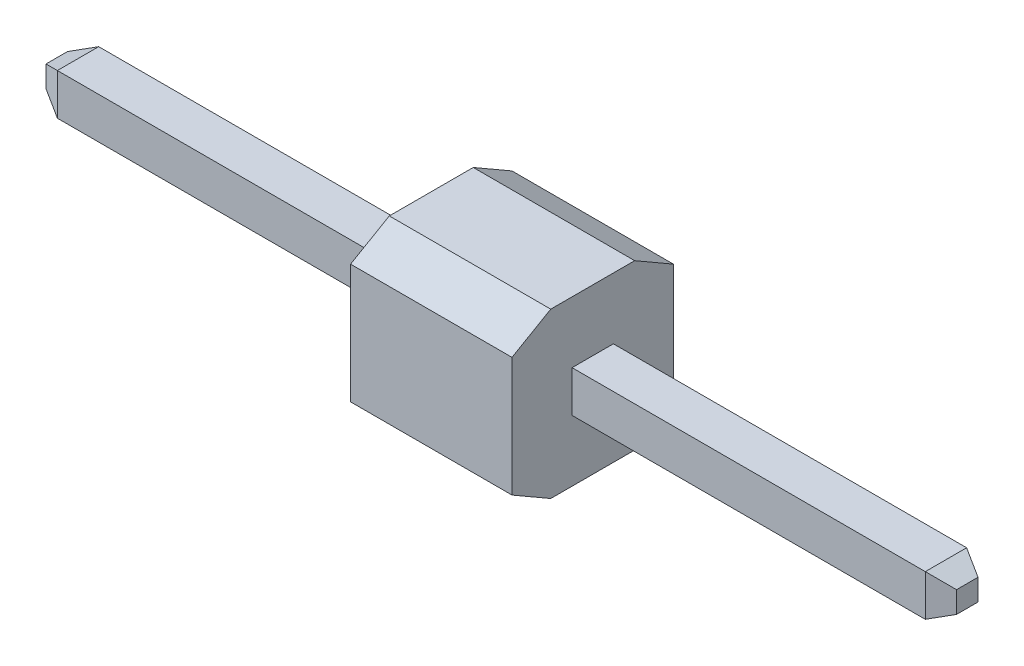
ISO-10303-21;
HEADER;
FILE_DESCRIPTION(('STEP AP214'),'2;1');
FILE_NAME('part.step','',(''),(''),'','','');
FILE_SCHEMA(('AUTOMOTIVE_DESIGN { 1 0 10303 214 1 1 1 1 }'));
ENDSEC;
DATA;
#1=APPLICATION_CONTEXT('core data for automotive mechanical design processes');
#2=APPLICATION_PROTOCOL_DEFINITION('international standard','automotive_design',2000,#1);
#3=PRODUCT_CONTEXT('',#1,'mechanical');
#4=PRODUCT('Part','Part','',(#3));
#5=PRODUCT_RELATED_PRODUCT_CATEGORY('part','',(#4));
#6=PRODUCT_DEFINITION_FORMATION('','',#4);
#7=PRODUCT_DEFINITION_CONTEXT('part definition',#1,'design');
#8=PRODUCT_DEFINITION('design','',#6,#7);
#9=PRODUCT_DEFINITION_SHAPE('','',#8);
#10=(LENGTH_UNIT() NAMED_UNIT(*) SI_UNIT(.MILLI.,.METRE.));
#11=(NAMED_UNIT(*) PLANE_ANGLE_UNIT() SI_UNIT($,.RADIAN.));
#12=(NAMED_UNIT(*) SI_UNIT($,.STERADIAN.) SOLID_ANGLE_UNIT());
#13=UNCERTAINTY_MEASURE_WITH_UNIT(LENGTH_MEASURE(1.E-05),#10,'distance_accuracy_value','');
#14=(GEOMETRIC_REPRESENTATION_CONTEXT(3) GLOBAL_UNCERTAINTY_ASSIGNED_CONTEXT((#13)) GLOBAL_UNIT_ASSIGNED_CONTEXT((#10,
#11,#12)) REPRESENTATION_CONTEXT('',''));
#15=CARTESIAN_POINT('',(0.,0.,0.));
#16=DIRECTION('',(0.,0.,1.));
#17=DIRECTION('',(1.,0.,0.));
#18=AXIS2_PLACEMENT_3D('',#15,#16,#17);
#19=CARTESIAN_POINT('',(5.42107527862679,-7.93712826291391,0.629998634255617));
#20=DIRECTION('',(1.,4.37113882867379E-08,-4.37113882867379E-08));
#21=DIRECTION('',(-4.37113882867379E-08,1.,0.));
#22=AXIS2_PLACEMENT_3D('',#19,#20,#21);
#23=PLANE('',#22);
#24=DIRECTION('',(1.59994777304463E-08,0.50000000000019,0.866025403784329));
#25=VECTOR('',#24,1.);
#26=CARTESIAN_POINT('',(5.42107515564087,-6.69353842442392,-0.940001365744382));
#27=LINE('',#26,#25);
#28=CARTESIAN_POINT('',(5.42107515564087,-6.69353842442392,-0.940001365744382));
#29=VERTEX_POINT('',#28);
#30=CARTESIAN_POINT('',(5.42107516672563,-6.34712826291392,-0.340001365744383));
#31=VERTEX_POINT('',#30);
#32=EDGE_CURVE('E11',#29,#31,#27,.T.);
#33=ORIENTED_EDGE('',*,*,#32,.T.);
#34=DIRECTION('',(4.37113886966664E-08,0.,0.999999999999999));
#35=VECTOR('',#34,1.);
#36=CARTESIAN_POINT('',(5.42107516672563,-6.34712826291392,-0.340001365744383));
#37=LINE('',#36,#35);
#38=CARTESIAN_POINT('',(5.42107522355044,-6.34712826291391,0.959998634255618));
#39=VERTEX_POINT('',#38);
#40=EDGE_CURVE('E304',#31,#39,#37,.T.);
#41=ORIENTED_EDGE('',*,*,#40,.T.);
#42=DIRECTION('',(5.97108668825761E-08,-0.500000000000186,0.86602540378433));
#43=VECTOR('',#42,1.);
#44=CARTESIAN_POINT('',(5.42107522355044,-6.34712826291391,0.959998634255618));
#45=LINE('',#44,#43);
#46=CARTESIAN_POINT('',(5.42107526491934,-6.69353842442391,1.55999863425562));
#47=VERTEX_POINT('',#46);
#48=EDGE_CURVE('E296',#39,#47,#45,.T.);
#49=ORIENTED_EDGE('',*,*,#48,.T.);
#50=DIRECTION('',(4.37113884815544E-08,-0.999999999999999,0.));
#51=VECTOR('',#50,1.);
#52=CARTESIAN_POINT('',(5.42107526491934,-6.69353842442391,1.55999863425562));
#53=LINE('',#52,#51);
#54=CARTESIAN_POINT('',(5.42107534566213,-8.54071810139391,1.55999863425562));
#55=VERTEX_POINT('',#54);
#56=EDGE_CURVE('E281',#47,#55,#53,.T.);
#57=ORIENTED_EDGE('',*,*,#56,.T.);
#58=DIRECTION('',(1.5999479012306E-08,0.500000000000192,0.866025403784328));
#59=VECTOR('',#58,1.);
#60=CARTESIAN_POINT('',(5.42107533457736,-8.88712826291391,0.959998634255618));
#61=LINE('',#60,#59);
#62=CARTESIAN_POINT('',(5.42107533457736,-8.88712826291391,0.959998634255618));
#63=VERTEX_POINT('',#62);
#64=EDGE_CURVE('E265',#63,#55,#61,.T.);
#65=ORIENTED_EDGE('',*,*,#64,.F.);
#66=DIRECTION('',(4.37113886966664E-08,0.,0.999999999999999));
#67=VECTOR('',#66,1.);
#68=CARTESIAN_POINT('',(5.42107527775256,-8.88712826291392,-0.340001365744383));
#69=LINE('',#68,#67);
#70=CARTESIAN_POINT('',(5.42107527775256,-8.88712826291392,-0.340001365744383));
#71=VERTEX_POINT('',#70);
#72=EDGE_CURVE('E248',#71,#63,#69,.T.);
#73=ORIENTED_EDGE('',*,*,#72,.F.);
#74=DIRECTION('',(5.97108656001701E-08,-0.500000000000187,0.866025403784328));
#75=VECTOR('',#74,1.);
#76=CARTESIAN_POINT('',(5.42107523638366,-8.54071810139392,-0.940001365744382));
#77=LINE('',#76,#75);
#78=CARTESIAN_POINT('',(5.42107523638366,-8.54071810139392,-0.940001365744382));
#79=VERTEX_POINT('',#78);
#80=EDGE_CURVE('E242',#79,#71,#77,.T.);
#81=ORIENTED_EDGE('',*,*,#80,.F.);
#82=DIRECTION('',(4.37113884815544E-08,-0.999999999999999,0.));
#83=VECTOR('',#82,1.);
#84=CARTESIAN_POINT('',(5.42107515564087,-6.69353842442392,-0.940001365744382));
#85=LINE('',#84,#83);
#86=EDGE_CURVE('E236',#29,#79,#85,.T.);
#87=ORIENTED_EDGE('',*,*,#86,.F.);
#88=EDGE_LOOP('',(#33,#41,#49,#57,#65,#73,#81,#87));
#89=FACE_BOUND('',#88,.T.);
#90=DIRECTION('',(-4.37113872875372E-08,0.,-0.999999999999999));
#91=VECTOR('',#90,1.);
#92=CARTESIAN_POINT('',(5.4210752506515,-7.29712826291391,0.629998634255617));
#93=LINE('',#92,#91);
#94=CARTESIAN_POINT('',(5.4210752506515,-7.29712826291391,0.629998634255617));
#95=VERTEX_POINT('',#94);
#96=CARTESIAN_POINT('',(5.42107522267621,-7.29712826291391,-0.0100013657443826));
#97=VERTEX_POINT('',#96);
#98=EDGE_CURVE('E302',#95,#97,#93,.T.);
#99=ORIENTED_EDGE('',*,*,#98,.T.);
#100=DIRECTION('',(-4.37113872875371E-08,0.999999999999999,0.));
#101=VECTOR('',#100,1.);
#102=CARTESIAN_POINT('',(5.4210752506515,-7.93712826291391,-0.0100013657443826));
#103=LINE('',#102,#101);
#104=CARTESIAN_POINT('',(5.4210752506515,-7.93712826291391,-0.0100013657443826));
#105=VERTEX_POINT('',#104);
#106=EDGE_CURVE('E293',#105,#97,#103,.T.);
#107=ORIENTED_EDGE('',*,*,#106,.F.);
#108=DIRECTION('',(-4.37113900630947E-08,0.,-0.999999999999999));
#109=VECTOR('',#108,1.);
#110=CARTESIAN_POINT('',(5.42107527862679,-7.93712826291391,0.629998634255617));
#111=LINE('',#110,#109);
#112=CARTESIAN_POINT('',(5.42107527862679,-7.93712826291391,0.629998634255617));
#113=VERTEX_POINT('',#112);
#114=EDGE_CURVE('E278',#113,#105,#111,.T.);
#115=ORIENTED_EDGE('',*,*,#114,.F.);
#116=DIRECTION('',(-4.37113900630947E-08,0.999999999999999,0.));
#117=VECTOR('',#116,1.);
#118=CARTESIAN_POINT('',(5.42107527862679,-7.93712826291391,0.629998634255617));
#119=LINE('',#118,#117);
#120=EDGE_CURVE('E263',#113,#95,#119,.T.);
#121=ORIENTED_EDGE('',*,*,#120,.T.);
#122=EDGE_LOOP('',(#99,#107,#115,#121));
#123=FACE_BOUND('',#122,.T.);
#124=ADVANCED_FACE('F17',(#89,#123),#23,.T.);
#125=CARTESIAN_POINT('',(2.92107527862679,-7.93712837219238,0.629998743534088));
#126=DIRECTION('',(1.,4.37113882867379E-08,-4.37113882867379E-08));
#127=DIRECTION('',(-4.37113882867379E-08,1.,0.));
#128=AXIS2_PLACEMENT_3D('',#125,#126,#127);
#129=PLANE('',#128);
#130=DIRECTION('',(1.59994783714339E-08,0.50000000000019,0.866025403784329));
#131=VECTOR('',#130,1.);
#132=CARTESIAN_POINT('',(2.92107515564087,-6.69353853370239,-0.940001256465912));
#133=LINE('',#132,#131);
#134=CARTESIAN_POINT('',(2.92107515564087,-6.69353853370239,-0.940001256465912));
#135=VERTEX_POINT('',#134);
#136=CARTESIAN_POINT('',(2.92107516672563,-6.34712837219239,-0.340001256465912));
#137=VERTEX_POINT('',#136);
#138=EDGE_CURVE('E24',#135,#137,#133,.T.);
#139=ORIENTED_EDGE('',*,*,#138,.F.);
#140=DIRECTION('',(4.37113882411396E-08,-0.999999999999999,0.));
#141=VECTOR('',#140,1.);
#142=CARTESIAN_POINT('',(2.92107515564087,-6.69353853370239,-0.940001256465912));
#143=LINE('',#142,#141);
#144=CARTESIAN_POINT('',(2.92107523638366,-8.54071821067239,-0.940001256465912));
#145=VERTEX_POINT('',#144);
#146=EDGE_CURVE('E300',#135,#145,#143,.T.);
#147=ORIENTED_EDGE('',*,*,#146,.T.);
#148=DIRECTION('',(5.97108668821452E-08,-0.500000000000187,0.866025403784328));
#149=VECTOR('',#148,1.);
#150=CARTESIAN_POINT('',(2.92107523638366,-8.54071821067239,-0.940001256465912));
#151=LINE('',#150,#149);
#152=CARTESIAN_POINT('',(2.92107527775256,-8.88712837219239,-0.340001256465912));
#153=VERTEX_POINT('',#152);
#154=EDGE_CURVE('E286',#145,#153,#151,.T.);
#155=ORIENTED_EDGE('',*,*,#154,.T.);
#156=DIRECTION('',(4.37113883550593E-08,0.,0.999999999999999));
#157=VECTOR('',#156,1.);
#158=CARTESIAN_POINT('',(2.92107527775256,-8.88712837219239,-0.340001256465912));
#159=LINE('',#158,#157);
#160=CARTESIAN_POINT('',(2.92107533457736,-8.88712837219238,0.959998743534088));
#161=VERTEX_POINT('',#160);
#162=EDGE_CURVE('E271',#153,#161,#159,.T.);
#163=ORIENTED_EDGE('',*,*,#162,.T.);
#164=DIRECTION('',(1.59994783713184E-08,0.500000000000192,0.866025403784328));
#165=VECTOR('',#164,1.);
#166=CARTESIAN_POINT('',(2.92107533457736,-8.88712837219238,0.959998743534088));
#167=LINE('',#166,#165);
#168=CARTESIAN_POINT('',(2.92107534566213,-8.54071821067238,1.55999874353409));
#169=VERTEX_POINT('',#168);
#170=EDGE_CURVE('E253',#161,#169,#167,.T.);
#171=ORIENTED_EDGE('',*,*,#170,.T.);
#172=DIRECTION('',(4.37113882411396E-08,-0.999999999999999,0.));
#173=VECTOR('',#172,1.);
#174=CARTESIAN_POINT('',(2.92107526491934,-6.69353853370238,1.55999874353409));
#175=LINE('',#174,#173);
#176=CARTESIAN_POINT('',(2.92107526491934,-6.69353853370238,1.55999874353409));
#177=VERTEX_POINT('',#176);
#178=EDGE_CURVE('E261',#177,#169,#175,.T.);
#179=ORIENTED_EDGE('',*,*,#178,.F.);
#180=DIRECTION('',(5.97108668825761E-08,-0.500000000000186,0.86602540378433));
#181=VECTOR('',#180,1.);
#182=CARTESIAN_POINT('',(2.92107522355044,-6.34712837219238,0.959998743534088));
#183=LINE('',#182,#181);
#184=CARTESIAN_POINT('',(2.92107522355044,-6.34712837219238,0.959998743534088));
#185=VERTEX_POINT('',#184);
#186=EDGE_CURVE('E276',#185,#177,#183,.T.);
#187=ORIENTED_EDGE('',*,*,#186,.F.);
#188=DIRECTION('',(4.37113883550593E-08,0.,0.999999999999999));
#189=VECTOR('',#188,1.);
#190=CARTESIAN_POINT('',(2.92107516672563,-6.34712837219239,-0.340001256465912));
#191=LINE('',#190,#189);
#192=EDGE_CURVE('E291',#137,#185,#191,.T.);
#193=ORIENTED_EDGE('',*,*,#192,.F.);
#194=EDGE_LOOP('',(#139,#147,#155,#163,#171,#179,#187,#193));
#195=FACE_BOUND('',#194,.T.);
#196=DIRECTION('',(-4.37113879814265E-08,0.999999999999999,0.));
#197=VECTOR('',#196,1.);
#198=CARTESIAN_POINT('',(2.9210752506515,-7.93712837219238,-0.0100012564659119));
#199=LINE('',#198,#197);
#200=CARTESIAN_POINT('',(2.9210752506515,-7.93712837219238,-0.0100012564659119));
#201=VERTEX_POINT('',#200);
#202=CARTESIAN_POINT('',(2.92107522267621,-7.29712837219238,-0.0100012564659119));
#203=VERTEX_POINT('',#202);
#204=EDGE_CURVE('E298',#201,#203,#199,.T.);
#205=ORIENTED_EDGE('',*,*,#204,.T.);
#206=DIRECTION('',(-4.37113879814266E-08,0.,-0.999999999999999));
#207=VECTOR('',#206,1.);
#208=CARTESIAN_POINT('',(2.9210752506515,-7.29712837219238,0.629998743534088));
#209=LINE('',#208,#207);
#210=CARTESIAN_POINT('',(2.9210752506515,-7.29712837219238,0.629998743534088));
#211=VERTEX_POINT('',#210);
#212=EDGE_CURVE('E283',#211,#203,#209,.T.);
#213=ORIENTED_EDGE('',*,*,#212,.F.);
#214=DIRECTION('',(-4.37113886753159E-08,0.999999999999999,0.));
#215=VECTOR('',#214,1.);
#216=CARTESIAN_POINT('',(2.92107527862679,-7.93712837219238,0.629998743534088));
#217=LINE('',#216,#215);
#218=CARTESIAN_POINT('',(2.92107527862679,-7.93712837219238,0.629998743534088));
#219=VERTEX_POINT('',#218);
#220=EDGE_CURVE('E268',#219,#211,#217,.T.);
#221=ORIENTED_EDGE('',*,*,#220,.F.);
#222=DIRECTION('',(-4.37113886753159E-08,0.,-0.999999999999999));
#223=VECTOR('',#222,1.);
#224=CARTESIAN_POINT('',(2.92107527862679,-7.93712837219238,0.629998743534088));
#225=LINE('',#224,#223);
#226=EDGE_CURVE('E251',#219,#201,#225,.T.);
#227=ORIENTED_EDGE('',*,*,#226,.T.);
#228=EDGE_LOOP('',(#205,#213,#221,#227));
#229=FACE_BOUND('',#228,.T.);
#230=ADVANCED_FACE('F314',(#195,#229),#129,.F.);
#231=CARTESIAN_POINT('',(5.42107515564087,-6.69353842442392,-0.940001365744382));
#232=DIRECTION('',(5.97108668343731E-08,-0.866025403784328,0.50000000000019));
#233=DIRECTION('',(-1.59994785476185E-08,-0.500000000000192,-0.866025403784329));
#234=AXIS2_PLACEMENT_3D('',#231,#232,#233);
#235=PLANE('',#234);
#236=ORIENTED_EDGE('',*,*,#138,.T.);
#237=DIRECTION('',(-0.999999999999998,-4.37113897078233E-08,4.37113883755557E-08));
#238=VECTOR('',#237,1.);
#239=CARTESIAN_POINT('',(5.42107516672563,-6.34712826291392,-0.340001365744383));
#240=LINE('',#239,#238);
#241=EDGE_CURVE('E288',#31,#137,#240,.T.);
#242=ORIENTED_EDGE('',*,*,#241,.F.);
#243=ORIENTED_EDGE('',*,*,#32,.F.);
#244=DIRECTION('',(-0.999999999999998,-4.37113868656524E-08,4.37113881091022E-08));
#245=VECTOR('',#244,1.);
#246=CARTESIAN_POINT('',(5.42107515564087,-6.69353842442392,-0.940001365744382));
#247=LINE('',#246,#245);
#248=EDGE_CURVE('E256',#29,#135,#247,.T.);
#249=ORIENTED_EDGE('',*,*,#248,.T.);
#250=EDGE_LOOP('',(#236,#242,#243,#249));
#251=FACE_BOUND('',#250,.T.);
#252=ADVANCED_FACE('F306',(#251),#235,.F.);
#253=CARTESIAN_POINT('',(5.42107516672563,-6.34712826291392,-0.340001365744383));
#254=DIRECTION('',(4.37113882867379E-08,-1.,0.));
#255=DIRECTION('',(1.,4.37113882867379E-08,-4.37113882867379E-08));
#256=AXIS2_PLACEMENT_3D('',#253,#254,#255);
#257=PLANE('',#256);
#258=ORIENTED_EDGE('',*,*,#192,.T.);
#259=DIRECTION('',(-0.999999999999998,-4.37113897078233E-08,4.37113882867378E-08));
#260=VECTOR('',#259,1.);
#261=CARTESIAN_POINT('',(5.42107522355044,-6.34712826291391,0.959998634255618));
#262=LINE('',#261,#260);
#263=EDGE_CURVE('E273',#39,#185,#262,.T.);
#264=ORIENTED_EDGE('',*,*,#263,.F.);
#265=ORIENTED_EDGE('',*,*,#40,.F.);
#266=ORIENTED_EDGE('',*,*,#241,.T.);
#267=EDGE_LOOP('',(#258,#264,#265,#266));
#268=FACE_BOUND('',#267,.T.);
#269=ADVANCED_FACE('F311',(#268),#257,.F.);
#270=CARTESIAN_POINT('',(5.42107522355044,-6.34712826291391,0.959998634255618));
#271=DIRECTION('',(1.59994785476185E-08,-0.86602540378433,-0.50000000000019));
#272=DIRECTION('',(-5.97108668343731E-08,0.500000000000188,-0.866025403784329));
#273=AXIS2_PLACEMENT_3D('',#270,#271,#272);
#274=PLANE('',#273);
#275=ORIENTED_EDGE('',*,*,#186,.T.);
#276=DIRECTION('',(-0.999999999999998,-4.37113868656524E-08,4.37113882867378E-08));
#277=VECTOR('',#276,1.);
#278=CARTESIAN_POINT('',(5.42107526491934,-6.69353842442391,1.55999863425562));
#279=LINE('',#278,#277);
#280=EDGE_CURVE('E258',#47,#177,#279,.T.);
#281=ORIENTED_EDGE('',*,*,#280,.F.);
#282=ORIENTED_EDGE('',*,*,#48,.F.);
#283=ORIENTED_EDGE('',*,*,#263,.T.);
#284=EDGE_LOOP('',(#275,#281,#282,#283));
#285=FACE_BOUND('',#284,.T.);
#286=ADVANCED_FACE('F319',(#285),#274,.F.);
#287=CARTESIAN_POINT('',(5.42107526491934,-6.69353842442391,1.55999863425562));
#288=DIRECTION('',(-4.37113882867379E-08,0.,-1.));
#289=DIRECTION('',(-1.,-4.37113882867379E-08,4.37113882867379E-08));
#290=AXIS2_PLACEMENT_3D('',#287,#288,#289);
#291=PLANE('',#290);
#292=ORIENTED_EDGE('',*,*,#178,.T.);
#293=DIRECTION('',(-0.999999999999998,-4.37113868656524E-08,4.37113882867378E-08));
#294=VECTOR('',#293,1.);
#295=CARTESIAN_POINT('',(5.42107534566213,-8.54071810139391,1.55999863425562));
#296=LINE('',#295,#294);
#297=EDGE_CURVE('E245',#55,#169,#296,.T.);
#298=ORIENTED_EDGE('',*,*,#297,.F.);
#299=ORIENTED_EDGE('',*,*,#56,.F.);
#300=ORIENTED_EDGE('',*,*,#280,.T.);
#301=EDGE_LOOP('',(#292,#298,#299,#300));
#302=FACE_BOUND('',#301,.T.);
#303=ADVANCED_FACE('F326',(#302),#291,.F.);
#304=CARTESIAN_POINT('',(5.42107533457736,-8.88712826291391,0.959998634255618));
#305=DIRECTION('',(5.97108668343731E-08,-0.866025403784328,0.50000000000019));
#306=DIRECTION('',(-1.59994785476185E-08,-0.500000000000192,-0.866025403784329));
#307=AXIS2_PLACEMENT_3D('',#304,#305,#306);
#308=PLANE('',#307);
#309=ORIENTED_EDGE('',*,*,#170,.F.);
#310=DIRECTION('',(-0.999999999999998,-4.37113868656524E-08,4.37113882867378E-08));
#311=VECTOR('',#310,1.);
#312=CARTESIAN_POINT('',(5.42107533457736,-8.88712826291391,0.959998634255618));
#313=LINE('',#312,#311);
#314=EDGE_CURVE('E239',#63,#161,#313,.T.);
#315=ORIENTED_EDGE('',*,*,#314,.F.);
#316=ORIENTED_EDGE('',*,*,#64,.T.);
#317=ORIENTED_EDGE('',*,*,#297,.T.);
#318=EDGE_LOOP('',(#309,#315,#316,#317));
#319=FACE_BOUND('',#318,.T.);
#320=ADVANCED_FACE('F329',(#319),#308,.T.);
#321=CARTESIAN_POINT('',(5.42107527775256,-8.88712826291392,-0.340001365744383));
#322=DIRECTION('',(4.37113882867379E-08,-1.,0.));
#323=DIRECTION('',(1.,4.37113882867379E-08,-4.37113882867379E-08));
#324=AXIS2_PLACEMENT_3D('',#321,#322,#323);
#325=PLANE('',#324);
#326=ORIENTED_EDGE('',*,*,#162,.F.);
#327=DIRECTION('',(-0.999999999999998,-4.37113868656524E-08,4.37113883755557E-08));
#328=VECTOR('',#327,1.);
#329=CARTESIAN_POINT('',(5.42107527775256,-8.88712826291392,-0.340001365744383));
#330=LINE('',#329,#328);
#331=EDGE_CURVE('E233',#71,#153,#330,.T.);
#332=ORIENTED_EDGE('',*,*,#331,.F.);
#333=ORIENTED_EDGE('',*,*,#72,.T.);
#334=ORIENTED_EDGE('',*,*,#314,.T.);
#335=EDGE_LOOP('',(#326,#332,#333,#334));
#336=FACE_BOUND('',#335,.T.);
#337=ADVANCED_FACE('F333',(#336),#325,.T.);
#338=CARTESIAN_POINT('',(5.42107523638366,-8.54071810139392,-0.940001365744382));
#339=DIRECTION('',(1.59994785476185E-08,-0.86602540378433,-0.50000000000019));
#340=DIRECTION('',(-5.97108668343731E-08,0.500000000000188,-0.866025403784329));
#341=AXIS2_PLACEMENT_3D('',#338,#339,#340);
#342=PLANE('',#341);
#343=ORIENTED_EDGE('',*,*,#154,.F.);
#344=DIRECTION('',(-0.999999999999998,-4.37113868656524E-08,4.37113881091021E-08));
#345=VECTOR('',#344,1.);
#346=CARTESIAN_POINT('',(5.42107523638366,-8.54071810139392,-0.940001365744382));
#347=LINE('',#346,#345);
#348=EDGE_CURVE('E230',#79,#145,#347,.T.);
#349=ORIENTED_EDGE('',*,*,#348,.F.);
#350=ORIENTED_EDGE('',*,*,#80,.T.);
#351=ORIENTED_EDGE('',*,*,#331,.T.);
#352=EDGE_LOOP('',(#343,#349,#350,#351));
#353=FACE_BOUND('',#352,.T.);
#354=ADVANCED_FACE('F337',(#353),#342,.T.);
#355=CARTESIAN_POINT('',(5.42107515564087,-6.69353842442392,-0.940001365744382));
#356=DIRECTION('',(-4.37113882867379E-08,0.,-1.));
#357=DIRECTION('',(-4.37113882867379E-08,1.,0.));
#358=AXIS2_PLACEMENT_3D('',#355,#356,#357);
#359=PLANE('',#358);
#360=ORIENTED_EDGE('',*,*,#146,.F.);
#361=ORIENTED_EDGE('',*,*,#248,.F.);
#362=ORIENTED_EDGE('',*,*,#86,.T.);
#363=ORIENTED_EDGE('',*,*,#348,.T.);
#364=EDGE_LOOP('',(#360,#361,#362,#363));
#365=FACE_BOUND('',#364,.T.);
#366=ADVANCED_FACE('F339',(#365),#359,.T.);
#367=CARTESIAN_POINT('',(-2.87892472137321,-7.93712862571844,0.62999899706014));
#368=DIRECTION('',(-1.,-4.37113882867379E-08,4.37113882867379E-08));
#369=DIRECTION('',(4.37113882867379E-08,-1.,0.));
#370=AXIS2_PLACEMENT_3D('',#367,#368,#369);
#371=PLANE('',#370);
#372=DIRECTION('',(4.37113927490808E-08,-0.999999999999999,0.));
#373=VECTOR('',#372,1.);
#374=CARTESIAN_POINT('',(-2.87892476387104,-7.45101015290844,0.14388052425114));
#375=LINE('',#374,#373);
#376=CARTESIAN_POINT('',(-2.87892476387104,-7.45101015290844,0.14388052425114));
#377=VERTEX_POINT('',#376);
#378=CARTESIAN_POINT('',(-2.8789247493485,-7.78324709851844,0.14388052425114));
#379=VERTEX_POINT('',#378);
#380=EDGE_CURVE('E228',#377,#379,#375,.T.);
#381=ORIENTED_EDGE('',*,*,#380,.T.);
#382=DIRECTION('',(4.37113874013716E-08,0.,0.999999999999999));
#383=VECTOR('',#382,1.);
#384=CARTESIAN_POINT('',(-2.8789247493485,-7.78324709851844,0.14388052425114));
#385=LINE('',#384,#383);
#386=CARTESIAN_POINT('',(-2.87892473482596,-7.78324709851844,0.47611746986914));
#387=VERTEX_POINT('',#386);
#388=EDGE_CURVE('E223',#379,#387,#385,.T.);
#389=ORIENTED_EDGE('',*,*,#388,.T.);
#390=DIRECTION('',(-4.37113900757526E-08,0.999999999999999,0.));
#391=VECTOR('',#390,1.);
#392=CARTESIAN_POINT('',(-2.87892473482596,-7.78324709851844,0.47611746986914));
#393=LINE('',#392,#391);
#394=CARTESIAN_POINT('',(-2.8789247493485,-7.45101015290844,0.47611746986914));
#395=VERTEX_POINT('',#394);
#396=EDGE_CURVE('E215',#387,#395,#393,.T.);
#397=ORIENTED_EDGE('',*,*,#396,.T.);
#398=DIRECTION('',(-4.37113847280434E-08,0.,-0.999999999999999));
#399=VECTOR('',#398,1.);
#400=CARTESIAN_POINT('',(-2.8789247493485,-7.45101015290844,0.47611746986914));
#401=LINE('',#400,#399);
#402=EDGE_CURVE('E207',#395,#377,#401,.T.);
#403=ORIENTED_EDGE('',*,*,#402,.T.);
#404=EDGE_LOOP('',(#381,#389,#397,#403));
#405=FACE_BOUND('',#404,.T.);
#406=ADVANCED_FACE('F341',(#405),#371,.T.);
#407=CARTESIAN_POINT('',(-2.87892472137321,-7.93712862571844,0.62999899706014));
#408=DIRECTION('',(4.37113882867379E-08,-1.,0.));
#409=DIRECTION('',(-4.37113882867379E-08,0.,-1.));
#410=AXIS2_PLACEMENT_3D('',#407,#408,#409);
#411=PLANE('',#410);
#412=DIRECTION('',(0.999999999999998,4.37113894947904E-08,-4.37113882769955E-08));
#413=VECTOR('',#412,1.);
#414=CARTESIAN_POINT('',(-2.54892472137321,-7.93712861129368,0.629998982635382));
#415=LINE('',#414,#413);
#416=CARTESIAN_POINT('',(-2.54892472137321,-7.93712861129368,0.629998982635382));
#417=VERTEX_POINT('',#416);
#418=EDGE_CURVE('E225',#417,#219,#415,.T.);
#419=ORIENTED_EDGE('',*,*,#418,.F.);
#420=DIRECTION('',(-4.37113872875372E-08,0.,-0.999999999999999));
#421=VECTOR('',#420,1.);
#422=CARTESIAN_POINT('',(-2.54892472137321,-7.93712861129368,0.629998982635382));
#423=LINE('',#422,#421);
#424=CARTESIAN_POINT('',(-2.5489247493485,-7.93712861129368,-0.010001017364618));
#425=VERTEX_POINT('',#424);
#426=EDGE_CURVE('E217',#417,#425,#423,.T.);
#427=ORIENTED_EDGE('',*,*,#426,.T.);
#428=DIRECTION('',(0.999999999999998,4.37113894947904E-08,-4.37113882161058E-08));
#429=VECTOR('',#428,1.);
#430=CARTESIAN_POINT('',(-2.5489247493485,-7.93712861129368,-0.010001017364618));
#431=LINE('',#430,#429);
#432=EDGE_CURVE('E220',#425,#201,#431,.T.);
#433=ORIENTED_EDGE('',*,*,#432,.T.);
#434=ORIENTED_EDGE('',*,*,#226,.F.);
#435=EDGE_LOOP('',(#419,#427,#433,#434));
#436=FACE_BOUND('',#435,.T.);
#437=ADVANCED_FACE('F348',(#436),#411,.T.);
#438=CARTESIAN_POINT('',(-2.8789247493485,-7.93712862571844,-0.0100010029398598));
#439=DIRECTION('',(-4.37113882867379E-08,0.,-1.));
#440=DIRECTION('',(-1.,-4.37113882867379E-08,4.37113882867379E-08));
#441=AXIS2_PLACEMENT_3D('',#438,#439,#440);
#442=PLANE('',#441);
#443=ORIENTED_EDGE('',*,*,#432,.F.);
#444=DIRECTION('',(-4.37113886753159E-08,0.999999999999999,0.));
#445=VECTOR('',#444,1.);
#446=CARTESIAN_POINT('',(-2.5489247493485,-7.93712861129368,-0.010001017364618));
#447=LINE('',#446,#445);
#448=CARTESIAN_POINT('',(-2.54892477732379,-7.29712861129368,-0.010001017364618));
#449=VERTEX_POINT('',#448);
#450=EDGE_CURVE('E209',#425,#449,#447,.T.);
#451=ORIENTED_EDGE('',*,*,#450,.T.);
#452=DIRECTION('',(0.999999999999998,4.37113894947904E-08,-4.37113882161057E-08));
#453=VECTOR('',#452,1.);
#454=CARTESIAN_POINT('',(-2.54892477732379,-7.29712861129368,-0.010001017364618));
#455=LINE('',#454,#453);
#456=EDGE_CURVE('E212',#449,#203,#455,.T.);
#457=ORIENTED_EDGE('',*,*,#456,.T.);
#458=ORIENTED_EDGE('',*,*,#204,.F.);
#459=EDGE_LOOP('',(#443,#451,#457,#458));
#460=FACE_BOUND('',#459,.T.);
#461=ADVANCED_FACE('F424',(#460),#442,.T.);
#462=CARTESIAN_POINT('',(-2.8789247493485,-7.29712862571844,0.62999899706014));
#463=DIRECTION('',(4.37113882867379E-08,-1.,0.));
#464=DIRECTION('',(-4.37113882867379E-08,0.,-1.));
#465=AXIS2_PLACEMENT_3D('',#462,#463,#464);
#466=PLANE('',#465);
#467=ORIENTED_EDGE('',*,*,#456,.F.);
#468=DIRECTION('',(4.37113900630947E-08,0.,0.999999999999999));
#469=VECTOR('',#468,1.);
#470=CARTESIAN_POINT('',(-2.54892477732379,-7.29712861129368,-0.010001017364618));
#471=LINE('',#470,#469);
#472=CARTESIAN_POINT('',(-2.5489247493485,-7.29712861129368,0.629998982635382));
#473=VERTEX_POINT('',#472);
#474=EDGE_CURVE('E201',#449,#473,#471,.T.);
#475=ORIENTED_EDGE('',*,*,#474,.T.);
#476=DIRECTION('',(0.999999999999998,4.37113894947904E-08,-4.37113882769955E-08));
#477=VECTOR('',#476,1.);
#478=CARTESIAN_POINT('',(-2.5489247493485,-7.29712861129368,0.629998982635382));
#479=LINE('',#478,#477);
#480=EDGE_CURVE('E204',#473,#211,#479,.T.);
#481=ORIENTED_EDGE('',*,*,#480,.T.);
#482=ORIENTED_EDGE('',*,*,#212,.T.);
#483=EDGE_LOOP('',(#467,#475,#481,#482));
#484=FACE_BOUND('',#483,.T.);
#485=ADVANCED_FACE('F421',(#484),#466,.F.);
#486=CARTESIAN_POINT('',(-2.87892472137321,-7.93712862571844,0.62999899706014));
#487=DIRECTION('',(-4.37113882867379E-08,0.,-1.));
#488=DIRECTION('',(-1.,-4.37113882867379E-08,4.37113882867379E-08));
#489=AXIS2_PLACEMENT_3D('',#486,#487,#488);
#490=PLANE('',#489);
#491=ORIENTED_EDGE('',*,*,#480,.F.);
#492=DIRECTION('',(4.37113858997583E-08,-0.999999999999999,0.));
#493=VECTOR('',#492,1.);
#494=CARTESIAN_POINT('',(-2.5489247493485,-7.29712861129368,0.629998982635382));
#495=LINE('',#494,#493);
#496=EDGE_CURVE('E196',#473,#417,#495,.T.);
#497=ORIENTED_EDGE('',*,*,#496,.T.);
#498=ORIENTED_EDGE('',*,*,#418,.T.);
#499=ORIENTED_EDGE('',*,*,#220,.T.);
#500=EDGE_LOOP('',(#491,#497,#498,#499));
#501=FACE_BOUND('',#500,.T.);
#502=ADVANCED_FACE('F376',(#501),#490,.F.);
#503=CARTESIAN_POINT('',(-2.87892472137321,-7.93712862571844,0.62999899706014));
#504=DIRECTION('',(-4.37113882867379E-08,0.,-1.));
#505=DIRECTION('',(-1.,-4.37113882867379E-08,4.37113882867379E-08));
#506=AXIS2_PLACEMENT_3D('',#503,#504,#505);
#507=PLANE('',#506);
#508=DIRECTION('',(0.999999999999998,4.37113881958092E-08,-4.37113882769955E-08));
#509=VECTOR('',#508,1.);
#510=CARTESIAN_POINT('',(5.42107527862679,-7.93712826291391,0.629998634255617));
#511=LINE('',#510,#509);
#512=CARTESIAN_POINT('',(10.8910752786268,-7.93712802381262,0.629998395154324));
#513=VERTEX_POINT('',#512);
#514=EDGE_CURVE('E199',#113,#513,#511,.T.);
#515=ORIENTED_EDGE('',*,*,#514,.T.);
#516=DIRECTION('',(-4.37113900630947E-08,0.999999999999999,0.));
#517=VECTOR('',#516,1.);
#518=CARTESIAN_POINT('',(10.8910752786268,-7.93712802381262,0.629998395154324));
#519=LINE('',#518,#517);
#520=CARTESIAN_POINT('',(10.8910752506515,-7.29712802381262,0.629998395154324));
#521=VERTEX_POINT('',#520);
#522=EDGE_CURVE('E191',#513,#521,#519,.T.);
#523=ORIENTED_EDGE('',*,*,#522,.T.);
#524=DIRECTION('',(0.999999999999998,4.37113829998842E-08,-4.37113882769955E-08));
#525=VECTOR('',#524,1.);
#526=CARTESIAN_POINT('',(5.4210752506515,-7.29712826291392,0.629998634255617));
#527=LINE('',#526,#525);
#528=EDGE_CURVE('E194',#95,#521,#527,.T.);
#529=ORIENTED_EDGE('',*,*,#528,.F.);
#530=ORIENTED_EDGE('',*,*,#120,.F.);
#531=EDGE_LOOP('',(#515,#523,#529,#530));
#532=FACE_BOUND('',#531,.T.);
#533=ADVANCED_FACE('F367',(#532),#507,.F.);
#534=CARTESIAN_POINT('',(-2.8789247493485,-7.29712862571844,0.62999899706014));
#535=DIRECTION('',(4.37113882867379E-08,-1.,0.));
#536=DIRECTION('',(-4.37113882867379E-08,0.,-1.));
#537=AXIS2_PLACEMENT_3D('',#534,#535,#536);
#538=PLANE('',#537);
#539=ORIENTED_EDGE('',*,*,#528,.T.);
#540=DIRECTION('',(-4.37113900630947E-08,0.,-0.999999999999999));
#541=VECTOR('',#540,1.);
#542=CARTESIAN_POINT('',(10.8910752506515,-7.29712802381262,0.629998395154324));
#543=LINE('',#542,#541);
#544=CARTESIAN_POINT('',(10.8910752226762,-7.29712802381262,-0.0100016048456765));
#545=VERTEX_POINT('',#544);
#546=EDGE_CURVE('E186',#521,#545,#543,.T.);
#547=ORIENTED_EDGE('',*,*,#546,.T.);
#548=DIRECTION('',(0.999999999999998,4.37113829998842E-08,-4.37113881146228E-08));
#549=VECTOR('',#548,1.);
#550=CARTESIAN_POINT('',(5.42107522267621,-7.29712826291392,-0.0100013657443823));
#551=LINE('',#550,#549);
#552=EDGE_CURVE('E189',#97,#545,#551,.T.);
#553=ORIENTED_EDGE('',*,*,#552,.F.);
#554=ORIENTED_EDGE('',*,*,#98,.F.);
#555=EDGE_LOOP('',(#539,#547,#553,#554));
#556=FACE_BOUND('',#555,.T.);
#557=ADVANCED_FACE('F364',(#556),#538,.F.);
#558=CARTESIAN_POINT('',(-2.8789247493485,-7.93712862571844,-0.0100010029398598));
#559=DIRECTION('',(-4.37113882867379E-08,0.,-1.));
#560=DIRECTION('',(-1.,-4.37113882867379E-08,4.37113882867379E-08));
#561=AXIS2_PLACEMENT_3D('',#558,#559,#560);
#562=PLANE('',#561);
#563=ORIENTED_EDGE('',*,*,#552,.T.);
#564=DIRECTION('',(4.37113872875371E-08,-0.999999999999999,0.));
#565=VECTOR('',#564,1.);
#566=CARTESIAN_POINT('',(10.8910752226762,-7.29712802381262,-0.0100016048456764));
#567=LINE('',#566,#565);
#568=CARTESIAN_POINT('',(10.8910752506515,-7.93712802381262,-0.0100016048456765));
#569=VERTEX_POINT('',#568);
#570=EDGE_CURVE('E176',#545,#569,#567,.T.);
#571=ORIENTED_EDGE('',*,*,#570,.T.);
#572=DIRECTION('',(0.999999999999998,4.37113881958092E-08,-4.37113881146228E-08));
#573=VECTOR('',#572,1.);
#574=CARTESIAN_POINT('',(5.4210752506515,-7.93712826291391,-0.0100013657443823));
#575=LINE('',#574,#573);
#576=EDGE_CURVE('E179',#105,#569,#575,.T.);
#577=ORIENTED_EDGE('',*,*,#576,.F.);
#578=ORIENTED_EDGE('',*,*,#106,.T.);
#579=EDGE_LOOP('',(#563,#571,#577,#578));
#580=FACE_BOUND('',#579,.T.);
#581=ADVANCED_FACE('F366',(#580),#562,.T.);
#582=CARTESIAN_POINT('',(-2.87892472137321,-7.93712862571844,0.62999899706014));
#583=DIRECTION('',(4.37113882867379E-08,-1.,0.));
#584=DIRECTION('',(-4.37113882867379E-08,0.,-1.));
#585=AXIS2_PLACEMENT_3D('',#582,#583,#584);
#586=PLANE('',#585);
#587=ORIENTED_EDGE('',*,*,#576,.T.);
#588=DIRECTION('',(4.37113845119796E-08,0.,0.999999999999999));
#589=VECTOR('',#588,1.);
#590=CARTESIAN_POINT('',(10.8910752506515,-7.93712802381262,-0.0100016048456765));
#591=LINE('',#590,#589);
#592=EDGE_CURVE('E167',#569,#513,#591,.T.);
#593=ORIENTED_EDGE('',*,*,#592,.T.);
#594=ORIENTED_EDGE('',*,*,#514,.F.);
#595=ORIENTED_EDGE('',*,*,#114,.T.);
#596=EDGE_LOOP('',(#587,#593,#594,#595));
#597=FACE_BOUND('',#596,.T.);
#598=ADVANCED_FACE('F373',(#597),#586,.T.);
#599=CARTESIAN_POINT('',(11.2210752786268,-7.93712800938786,0.629998380729565));
#600=DIRECTION('',(-1.,-4.37113882867379E-08,4.37113882867379E-08));
#601=DIRECTION('',(4.37113882867379E-08,-1.,0.));
#602=AXIS2_PLACEMENT_3D('',#599,#600,#601);
#603=PLANE('',#602);
#604=DIRECTION('',(-4.37113874024243E-08,0.999999999999999,0.));
#605=VECTOR('',#604,1.);
#606=CARTESIAN_POINT('',(11.2210752506515,-7.78324648218786,0.143879907920565));
#607=LINE('',#606,#605);
#608=CARTESIAN_POINT('',(11.2210752506515,-7.78324648218786,0.143879907920565));
#609=VERTEX_POINT('',#608);
#610=CARTESIAN_POINT('',(11.221075236129,-7.45100953657786,0.143879907920565));
#611=VERTEX_POINT('',#610);
#612=EDGE_CURVE('E153',#609,#611,#607,.T.);
#613=ORIENTED_EDGE('',*,*,#612,.T.);
#614=DIRECTION('',(4.37113874013716E-08,0.,0.999999999999999));
#615=VECTOR('',#614,1.);
#616=CARTESIAN_POINT('',(11.221075236129,-7.45100953657786,0.143879907920565));
#617=LINE('',#616,#615);
#618=CARTESIAN_POINT('',(11.2210752506515,-7.45100953657786,0.476116853538565));
#619=VERTEX_POINT('',#618);
#620=EDGE_CURVE('E395',#611,#619,#617,.T.);
#621=ORIENTED_EDGE('',*,*,#620,.T.);
#622=DIRECTION('',(4.37113874024243E-08,-0.999999999999999,0.));
#623=VECTOR('',#622,1.);
#624=CARTESIAN_POINT('',(11.2210752506515,-7.45100953657786,0.476116853538565));
#625=LINE('',#624,#623);
#626=CARTESIAN_POINT('',(11.221075265174,-7.78324648218786,0.476116853538565));
#627=VERTEX_POINT('',#626);
#628=EDGE_CURVE('E156',#619,#627,#625,.T.);
#629=ORIENTED_EDGE('',*,*,#628,.T.);
#630=DIRECTION('',(-4.37113927480282E-08,0.,-0.999999999999999));
#631=VECTOR('',#630,1.);
#632=CARTESIAN_POINT('',(11.221075265174,-7.78324648218786,0.476116853538565));
#633=LINE('',#632,#631);
#634=EDGE_CURVE('E149',#627,#609,#633,.T.);
#635=ORIENTED_EDGE('',*,*,#634,.T.);
#636=EDGE_LOOP('',(#613,#621,#629,#635));
#637=FACE_BOUND('',#636,.T.);
#638=ADVANCED_FACE('F151',(#637),#603,.F.);
#639=CARTESIAN_POINT('',(-2.87892474262213,-7.45101015290844,0.62999899706014));
#640=DIRECTION('',(-0.422618301356784,0.906307768563367,1.84732310895534E-08));
#641=DIRECTION('',(4.37113882867379E-08,0.,1.));
#642=AXIS2_PLACEMENT_3D('',#639,#640,#641);
#643=PLANE('',#642);
#644=DIRECTION('',(0.834817095446925,0.38928165712602,-0.389281657126018));
#645=VECTOR('',#644,1.);
#646=CARTESIAN_POINT('',(-2.87892476387106,-7.45101015290792,0.143880524251623));
#647=LINE('',#646,#645);
#648=EDGE_CURVE('E181',#377,#449,#647,.T.);
#649=ORIENTED_EDGE('',*,*,#648,.F.);
#650=ORIENTED_EDGE('',*,*,#402,.F.);
#651=DIRECTION('',(-0.834817129479007,-0.389281657126019,-0.389281584143986));
#652=VECTOR('',#651,1.);
#653=CARTESIAN_POINT('',(-2.54892474934893,-7.29712861129221,0.629998982634844));
#654=LINE('',#653,#652);
#655=EDGE_CURVE('E404',#473,#395,#654,.T.);
#656=ORIENTED_EDGE('',*,*,#655,.F.);
#657=ORIENTED_EDGE('',*,*,#474,.F.);
#658=EDGE_LOOP('',(#649,#650,#656,#657));
#659=FACE_BOUND('',#658,.T.);
#660=ADVANCED_FACE('F418',(#659),#643,.T.);
#661=CARTESIAN_POINT('',(-2.87892472809959,-7.93712862571844,0.47611746986914));
#662=DIRECTION('',(-0.422618222124841,-1.84732292043498E-08,0.906307805509828));
#663=DIRECTION('',(4.37113882867379E-08,-1.,0.));
#664=AXIS2_PLACEMENT_3D('',#661,#662,#663);
#665=PLANE('',#664);
#666=ORIENTED_EDGE('',*,*,#655,.T.);
#667=ORIENTED_EDGE('',*,*,#396,.F.);
#668=DIRECTION('',(-0.834817163511087,0.389281584143985,-0.389281584143987));
#669=VECTOR('',#668,1.);
#670=CARTESIAN_POINT('',(-2.54892472137207,-7.93712861129095,0.629998982635654));
#671=LINE('',#670,#669);
#672=EDGE_CURVE('E160',#417,#387,#671,.T.);
#673=ORIENTED_EDGE('',*,*,#672,.F.);
#674=ORIENTED_EDGE('',*,*,#496,.F.);
#675=EDGE_LOOP('',(#666,#667,#673,#674));
#676=FACE_BOUND('',#675,.T.);
#677=ADVANCED_FACE('F434',(#676),#665,.T.);
#678=CARTESIAN_POINT('',(-2.5489247493485,-7.93712861129368,-0.010001017364618));
#679=DIRECTION('',(0.422618301356784,1.8473232667688E-08,0.906307768563367));
#680=DIRECTION('',(-4.37113882867379E-08,1.,0.));
#681=AXIS2_PLACEMENT_3D('',#678,#679,#680);
#682=PLANE('',#681);
#683=ORIENTED_EDGE('',*,*,#648,.T.);
#684=ORIENTED_EDGE('',*,*,#450,.F.);
#685=DIRECTION('',(0.834817129479008,-0.389281584143985,-0.389281657126018));
#686=VECTOR('',#685,1.);
#687=CARTESIAN_POINT('',(-2.87892474935134,-7.78324709852598,0.1438805242526));
#688=LINE('',#687,#686);
#689=EDGE_CURVE('E170',#379,#425,#688,.T.);
#690=ORIENTED_EDGE('',*,*,#689,.F.);
#691=ORIENTED_EDGE('',*,*,#380,.F.);
#692=EDGE_LOOP('',(#683,#684,#690,#691));
#693=FACE_BOUND('',#692,.T.);
#694=ADVANCED_FACE('F413',(#693),#682,.F.);
#695=CARTESIAN_POINT('',(-2.54892472137321,-7.93712861129368,0.629998982635382));
#696=DIRECTION('',(0.422618222124841,0.906307805509828,-1.84732308250282E-08));
#697=DIRECTION('',(-4.37113882867379E-08,0.,-1.));
#698=AXIS2_PLACEMENT_3D('',#695,#696,#697);
#699=PLANE('',#698);
#700=ORIENTED_EDGE('',*,*,#672,.T.);
#701=ORIENTED_EDGE('',*,*,#388,.F.);
#702=ORIENTED_EDGE('',*,*,#689,.T.);
#703=ORIENTED_EDGE('',*,*,#426,.F.);
#704=EDGE_LOOP('',(#700,#701,#702,#703));
#705=FACE_BOUND('',#704,.T.);
#706=ADVANCED_FACE('F429',(#705),#699,.F.);
#707=CARTESIAN_POINT('',(11.2210752719004,-7.78324648218786,0.629998380729565));
#708=DIRECTION('',(0.422618301356784,-0.906307768563367,-1.84732310470096E-08));
#709=DIRECTION('',(4.37113882867379E-08,0.,1.));
#710=AXIS2_PLACEMENT_3D('',#707,#708,#709);
#711=PLANE('',#710);
#712=DIRECTION('',(-0.834817129479004,-0.389281657126025,-0.389281584143987));
#713=VECTOR('',#712,1.);
#714=CARTESIAN_POINT('',(11.2210752506515,-7.78324648218838,0.143879907921048));
#715=LINE('',#714,#713);
#716=EDGE_CURVE('E164',#609,#569,#715,.T.);
#717=ORIENTED_EDGE('',*,*,#716,.F.);
#718=ORIENTED_EDGE('',*,*,#634,.F.);
#719=DIRECTION('',(0.834817095446923,0.389281657126025,-0.389281657126018));
#720=VECTOR('',#719,1.);
#721=CARTESIAN_POINT('',(10.8910752786268,-7.93712802381262,0.629998395154324));
#722=LINE('',#721,#720);
#723=EDGE_CURVE('E392',#513,#627,#722,.T.);
#724=ORIENTED_EDGE('',*,*,#723,.F.);
#725=ORIENTED_EDGE('',*,*,#592,.F.);
#726=EDGE_LOOP('',(#717,#718,#724,#725));
#727=FACE_BOUND('',#726,.T.);
#728=ADVANCED_FACE('F165',(#727),#711,.T.);
#729=CARTESIAN_POINT('',(10.8910752786268,-7.93712802381262,0.629998395154324));
#730=DIRECTION('',(-0.422618301356784,-1.8473232667688E-08,-0.906307768563367));
#731=DIRECTION('',(-4.37113882867379E-08,1.,0.));
#732=AXIS2_PLACEMENT_3D('',#729,#730,#731);
#733=PLANE('',#732);
#734=ORIENTED_EDGE('',*,*,#723,.T.);
#735=ORIENTED_EDGE('',*,*,#628,.F.);
#736=DIRECTION('',(0.834817129479006,-0.389281584143989,-0.38928165712602));
#737=VECTOR('',#736,1.);
#738=CARTESIAN_POINT('',(10.891075250653,-7.29712802380841,0.629998395153421));
#739=LINE('',#738,#737);
#740=EDGE_CURVE('E389',#521,#619,#739,.T.);
#741=ORIENTED_EDGE('',*,*,#740,.F.);
#742=ORIENTED_EDGE('',*,*,#522,.F.);
#743=EDGE_LOOP('',(#734,#735,#741,#742));
#744=FACE_BOUND('',#743,.T.);
#745=ADVANCED_FACE('F390',(#744),#733,.F.);
#746=CARTESIAN_POINT('',(11.2210752573779,-7.93712800938786,0.143879907920565));
#747=DIRECTION('',(0.422618222124841,1.84732292043498E-08,-0.906307805509828));
#748=DIRECTION('',(4.37113882867379E-08,-1.,0.));
#749=AXIS2_PLACEMENT_3D('',#746,#747,#748);
#750=PLANE('',#749);
#751=ORIENTED_EDGE('',*,*,#716,.T.);
#752=ORIENTED_EDGE('',*,*,#570,.F.);
#753=DIRECTION('',(-0.834817163511088,0.389281584143981,-0.389281584143989));
#754=VECTOR('',#753,1.);
#755=CARTESIAN_POINT('',(11.221075236129,-7.45100953657734,0.143879907921048));
#756=LINE('',#755,#754);
#757=EDGE_CURVE('E175',#611,#545,#756,.T.);
#758=ORIENTED_EDGE('',*,*,#757,.F.);
#759=ORIENTED_EDGE('',*,*,#612,.F.);
#760=EDGE_LOOP('',(#751,#752,#758,#759));
#761=FACE_BOUND('',#760,.T.);
#762=ADVANCED_FACE('F173',(#761),#750,.T.);
#763=CARTESIAN_POINT('',(10.8910752506515,-7.29712802381262,0.629998395154324));
#764=DIRECTION('',(-0.422618222124841,-0.906307805509828,1.84732307824844E-08));
#765=DIRECTION('',(-4.37113882867379E-08,0.,-1.));
#766=AXIS2_PLACEMENT_3D('',#763,#764,#765);
#767=PLANE('',#766);
#768=ORIENTED_EDGE('',*,*,#740,.T.);
#769=ORIENTED_EDGE('',*,*,#620,.F.);
#770=ORIENTED_EDGE('',*,*,#757,.T.);
#771=ORIENTED_EDGE('',*,*,#546,.F.);
#772=EDGE_LOOP('',(#768,#769,#770,#771));
#773=FACE_BOUND('',#772,.T.);
#774=ADVANCED_FACE('F394',(#773),#767,.F.);
#775=CLOSED_SHELL('',(#124,#230,#252,#269,#286,#303,#320,#337,#354,#366,#406,#437,#461,#485,
#502,#533,#557,#581,#598,#638,#660,#677,#694,#706,#728,#745,#762,#774));
#776=MANIFOLD_SOLID_BREP('B1',#775);
#777=ADVANCED_BREP_SHAPE_REPRESENTATION('',(#18,#776),#14);
#778=SHAPE_DEFINITION_REPRESENTATION(#9,#777);
ENDSEC;
END-ISO-10303-21;
